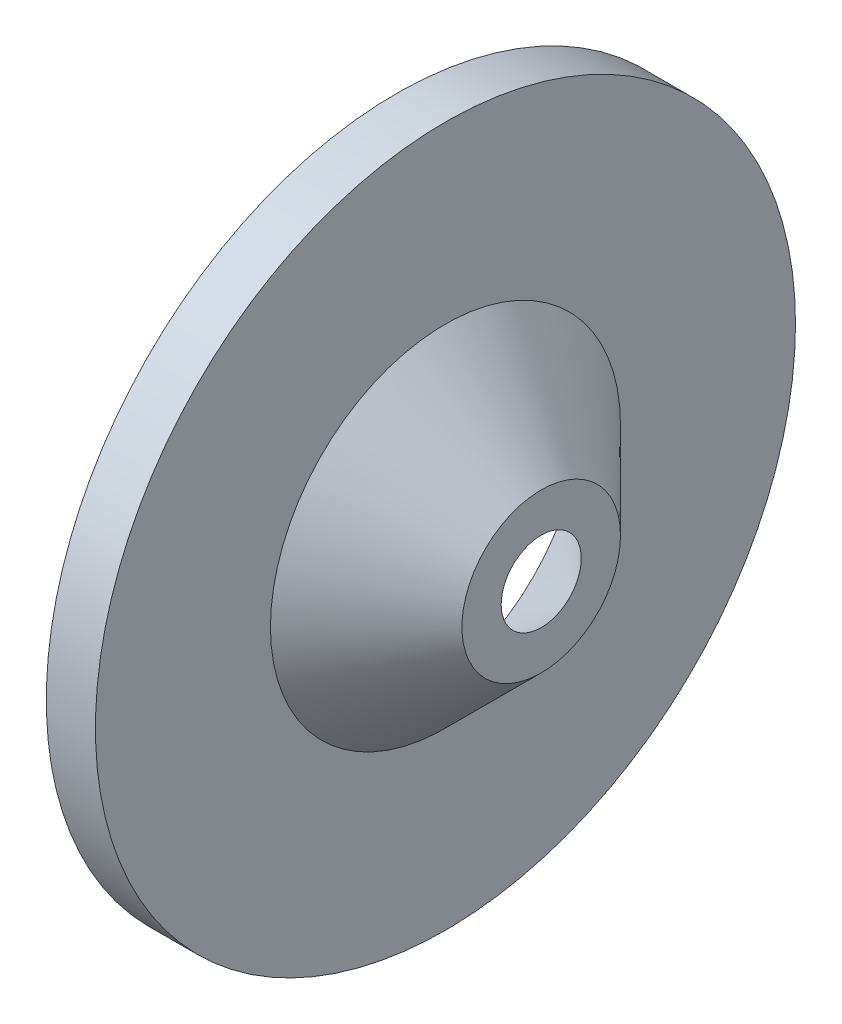
ISO-10303-21;
HEADER;
FILE_DESCRIPTION(('STEP AP214'),'2;1');
FILE_NAME('part.step','',(''),(''),'','','');
FILE_SCHEMA(('AUTOMOTIVE_DESIGN { 1 0 10303 214 1 1 1 1 }'));
ENDSEC;
DATA;
#1=APPLICATION_CONTEXT('core data for automotive mechanical design processes');
#2=APPLICATION_PROTOCOL_DEFINITION('international standard','automotive_design',2000,#1);
#3=PRODUCT_CONTEXT('',#1,'mechanical');
#4=PRODUCT('Part','Part','',(#3));
#5=PRODUCT_RELATED_PRODUCT_CATEGORY('part','',(#4));
#6=PRODUCT_DEFINITION_FORMATION('','',#4);
#7=PRODUCT_DEFINITION_CONTEXT('part definition',#1,'design');
#8=PRODUCT_DEFINITION('design','',#6,#7);
#9=PRODUCT_DEFINITION_SHAPE('','',#8);
#10=(LENGTH_UNIT() NAMED_UNIT(*) SI_UNIT(.MILLI.,.METRE.));
#11=(NAMED_UNIT(*) PLANE_ANGLE_UNIT() SI_UNIT($,.RADIAN.));
#12=(NAMED_UNIT(*) SI_UNIT($,.STERADIAN.) SOLID_ANGLE_UNIT());
#13=UNCERTAINTY_MEASURE_WITH_UNIT(LENGTH_MEASURE(1.E-05),#10,'distance_accuracy_value','');
#14=(GEOMETRIC_REPRESENTATION_CONTEXT(3) GLOBAL_UNCERTAINTY_ASSIGNED_CONTEXT((#13)) GLOBAL_UNIT_ASSIGNED_CONTEXT((#10,
#11,#12)) REPRESENTATION_CONTEXT('',''));
#15=CARTESIAN_POINT('',(0.,0.,0.));
#16=DIRECTION('',(0.,0.,1.));
#17=DIRECTION('',(1.,0.,0.));
#18=AXIS2_PLACEMENT_3D('',#15,#16,#17);
#19=CARTESIAN_POINT('',(0.,53.4279110522621,0.));
#20=DIRECTION('',(1.,0.,0.));
#21=DIRECTION('',(0.,0.,-1.));
#22=AXIS2_PLACEMENT_3D('',#19,#20,#21);
#23=PLANE('',#22);
#24=CARTESIAN_POINT('',(0.,53.4279110522621,0.));
#25=DIRECTION('',(1.,0.,0.));
#26=DIRECTION('',(0.,0.,-1.));
#27=AXIS2_PLACEMENT_3D('',#24,#25,#26);
#28=CIRCLE('',#27,116.138338813252);
#29=CARTESIAN_POINT('',(0.,53.4279110522621,-116.138338813252));
#30=VERTEX_POINT('',#29);
#31=EDGE_CURVE('E50',#30,#30,#28,.T.);
#32=ORIENTED_EDGE('',*,*,#31,.T.);
#33=EDGE_LOOP('',(#32));
#34=FACE_BOUND('',#33,.T.);
#35=CARTESIAN_POINT('',(0.,53.4279110522621,0.));
#36=DIRECTION('',(1.,0.,0.));
#37=DIRECTION('',(0.,0.,-1.));
#38=AXIS2_PLACEMENT_3D('',#35,#36,#37);
#39=CIRCLE('',#38,126.138338813252);
#40=CARTESIAN_POINT('',(0.,53.4279110522621,-126.138338813252));
#41=VERTEX_POINT('',#40);
#42=EDGE_CURVE('E10',#41,#41,#39,.T.);
#43=ORIENTED_EDGE('',*,*,#42,.F.);
#44=EDGE_LOOP('',(#43));
#45=FACE_BOUND('',#44,.T.);
#46=ADVANCED_FACE('F31',(#34,#45),#23,.F.);
#47=CARTESIAN_POINT('',(52.2034542362938,53.4279110522621,0.));
#48=DIRECTION('',(1.,0.,0.));
#49=DIRECTION('',(0.,0.,-1.));
#50=AXIS2_PLACEMENT_3D('',#47,#48,#49);
#51=CYLINDRICAL_SURFACE('',#50,126.138338813252);
#52=CARTESIAN_POINT('',(17.7032346079048,53.4279110522621,0.));
#53=DIRECTION('',(1.,0.,0.));
#54=DIRECTION('',(0.,0.,-1.));
#55=AXIS2_PLACEMENT_3D('',#52,#53,#54);
#56=CIRCLE('',#55,126.138338813252);
#57=CARTESIAN_POINT('',(17.7032346079048,53.4279110522621,-126.138338813252));
#58=VERTEX_POINT('',#57);
#59=EDGE_CURVE('E37',#58,#58,#56,.T.);
#60=ORIENTED_EDGE('',*,*,#59,.F.);
#61=EDGE_LOOP('',(#60));
#62=FACE_BOUND('',#61,.T.);
#63=ORIENTED_EDGE('',*,*,#42,.T.);
#64=EDGE_LOOP('',(#63));
#65=FACE_BOUND('',#64,.T.);
#66=ADVANCED_FACE('F80',(#62,#65),#51,.T.);
#67=CARTESIAN_POINT('',(17.7032346079048,-72.7104277609898,0.));
#68=DIRECTION('',(-1.,0.,0.));
#69=DIRECTION('',(0.,0.,1.));
#70=AXIS2_PLACEMENT_3D('',#67,#68,#69);
#71=PLANE('',#70);
#72=CARTESIAN_POINT('',(17.7032346079048,53.4279110522621,0.));
#73=DIRECTION('',(1.,0.,0.));
#74=DIRECTION('',(0.,0.,-1.));
#75=AXIS2_PLACEMENT_3D('',#72,#73,#74);
#76=CIRCLE('',#75,63.0691694066259);
#77=CARTESIAN_POINT('',(17.7032346079048,53.4279110522621,-63.0691694066259));
#78=VERTEX_POINT('',#77);
#79=EDGE_CURVE('E41',#78,#78,#76,.T.);
#80=ORIENTED_EDGE('',*,*,#79,.F.);
#81=EDGE_LOOP('',(#80));
#82=FACE_BOUND('',#81,.T.);
#83=ORIENTED_EDGE('',*,*,#59,.T.);
#84=EDGE_LOOP('',(#83));
#85=FACE_BOUND('',#84,.T.);
#86=ADVANCED_FACE('F85',(#82,#85),#71,.F.);
#87=CARTESIAN_POINT('',(17.7032346079048,53.4279110522621,0.));
#88=DIRECTION('',(-1.,0.,0.));
#89=DIRECTION('',(0.,0.,1.));
#90=AXIS2_PLACEMENT_3D('',#87,#88,#89);
#91=CONICAL_SURFACE('',#90,63.0691694066259,0.78539816339746);
#92=CARTESIAN_POINT('',(52.2034542362938,53.4279110522621,0.));
#93=DIRECTION('',(1.,0.,0.));
#94=DIRECTION('',(0.,0.,-1.));
#95=AXIS2_PLACEMENT_3D('',#92,#93,#94);
#96=CIRCLE('',#95,28.5689497782361);
#97=CARTESIAN_POINT('',(52.2034542362938,53.4279110522621,-28.5689497782361));
#98=VERTEX_POINT('',#97);
#99=EDGE_CURVE('E45',#98,#98,#96,.T.);
#100=ORIENTED_EDGE('',*,*,#99,.F.);
#101=EDGE_LOOP('',(#100));
#102=FACE_BOUND('',#101,.T.);
#103=ORIENTED_EDGE('',*,*,#79,.T.);
#104=EDGE_LOOP('',(#103));
#105=FACE_BOUND('',#104,.T.);
#106=ADVANCED_FACE('F92',(#102,#105),#91,.T.);
#107=CARTESIAN_POINT('',(52.2034542362938,24.858961274026,0.));
#108=DIRECTION('',(-1.,0.,0.));
#109=DIRECTION('',(0.,0.,1.));
#110=AXIS2_PLACEMENT_3D('',#107,#108,#109);
#111=PLANE('',#110);
#112=CARTESIAN_POINT('',(52.2034542362938,53.4279110522621,0.));
#113=DIRECTION('',(-1.,0.,0.));
#114=DIRECTION('',(0.,0.,1.));
#115=AXIS2_PLACEMENT_3D('',#112,#113,#114);
#116=CIRCLE('',#115,14.426814154505);
#117=CARTESIAN_POINT('',(52.2034542362938,53.4279110522621,14.426814154505));
#118=VERTEX_POINT('',#117);
#119=EDGE_CURVE('E51',#118,#118,#116,.F.);
#120=ORIENTED_EDGE('',*,*,#119,.F.);
#121=EDGE_LOOP('',(#120));
#122=FACE_BOUND('',#121,.T.);
#123=ORIENTED_EDGE('',*,*,#99,.T.);
#124=EDGE_LOOP('',(#123));
#125=FACE_BOUND('',#124,.T.);
#126=ADVANCED_FACE('F77',(#122,#125),#111,.F.);
#127=CARTESIAN_POINT('',(52.2034542362938,53.4279110522621,0.));
#128=DIRECTION('',(1.,0.,0.));
#129=DIRECTION('',(0.,0.,-1.));
#130=AXIS2_PLACEMENT_3D('',#127,#128,#129);
#131=CYLINDRICAL_SURFACE('',#130,116.138338813252);
#132=CARTESIAN_POINT('',(7.70323460790479,53.4279110522621,0.));
#133=DIRECTION('',(-1.,0.,0.));
#134=DIRECTION('',(0.,0.,1.));
#135=AXIS2_PLACEMENT_3D('',#132,#133,#134);
#136=CIRCLE('',#135,116.138338813252);
#137=CARTESIAN_POINT('',(7.70323460790479,53.4279110522621,116.138338813252));
#138=VERTEX_POINT('',#137);
#139=EDGE_CURVE('E57',#138,#138,#136,.F.);
#140=ORIENTED_EDGE('',*,*,#139,.T.);
#141=EDGE_LOOP('',(#140));
#142=FACE_BOUND('',#141,.T.);
#143=ORIENTED_EDGE('',*,*,#31,.F.);
#144=EDGE_LOOP('',(#143));
#145=FACE_BOUND('',#144,.T.);
#146=ADVANCED_FACE('F63',(#142,#145),#131,.F.);
#147=CARTESIAN_POINT('',(7.70323460790479,-72.7104277609898,0.));
#148=DIRECTION('',(-1.,0.,0.));
#149=DIRECTION('',(0.,0.,1.));
#150=AXIS2_PLACEMENT_3D('',#147,#148,#149);
#151=PLANE('',#150);
#152=CARTESIAN_POINT('',(7.70323460790479,53.4279110522621,0.));
#153=DIRECTION('',(-1.,0.,0.));
#154=DIRECTION('',(0.,0.,1.));
#155=AXIS2_PLACEMENT_3D('',#152,#153,#154);
#156=CIRCLE('',#155,58.927033782895);
#157=CARTESIAN_POINT('',(7.7032346079048,53.4279110522621,58.927033782895));
#158=VERTEX_POINT('',#157);
#159=EDGE_CURVE('E54',#158,#158,#156,.F.);
#160=ORIENTED_EDGE('',*,*,#159,.T.);
#161=EDGE_LOOP('',(#160));
#162=FACE_BOUND('',#161,.T.);
#163=ORIENTED_EDGE('',*,*,#139,.F.);
#164=EDGE_LOOP('',(#163));
#165=FACE_BOUND('',#164,.T.);
#166=ADVANCED_FACE('F66',(#162,#165),#151,.T.);
#167=CARTESIAN_POINT('',(10.6321667960392,53.4279110522621,0.));
#168=DIRECTION('',(-1.,0.,0.));
#169=DIRECTION('',(0.,0.,1.));
#170=AXIS2_PLACEMENT_3D('',#167,#168,#169);
#171=CONICAL_SURFACE('',#170,55.9981015947605,0.78539816339746);
#172=CARTESIAN_POINT('',(52.2034542362938,53.4279110522621,14.426814154505));
#173=CARTESIAN_POINT('',(51.7399102818314,53.4279110522621,14.8903581089674));
#174=CARTESIAN_POINT('',(51.276366327369,53.4279110522621,15.3539020634298));
#175=CARTESIAN_POINT('',(50.3492784184442,53.4279110522621,16.2809899723546));
#176=CARTESIAN_POINT('',(49.8857344639819,53.4279110522621,16.7445339268169));
#177=CARTESIAN_POINT('',(48.9586465550571,53.4279110522621,17.6716218357417));
#178=CARTESIAN_POINT('',(48.4951026005947,53.4279110522621,18.1351657902041));
#179=CARTESIAN_POINT('',(47.5680146916699,53.4279110522621,19.0622536991289));
#180=CARTESIAN_POINT('',(47.1044707372075,53.4279110522621,19.5257976535913));
#181=CARTESIAN_POINT('',(46.1773828282828,53.4279110522621,20.4528855625161));
#182=CARTESIAN_POINT('',(45.7138388738204,53.4279110522621,20.9164295169785));
#183=CARTESIAN_POINT('',(44.7867509648956,53.4279110522621,21.8435174259033));
#184=CARTESIAN_POINT('',(44.3232070104332,53.4279110522621,22.3070613803657));
#185=CARTESIAN_POINT('',(43.3961191015085,53.4279110522621,23.2341492892905));
#186=CARTESIAN_POINT('',(42.9325751470461,53.4279110522621,23.6976932437529));
#187=CARTESIAN_POINT('',(42.0054872381213,53.4279110522621,24.6247811526777));
#188=CARTESIAN_POINT('',(41.5419432836589,53.4279110522621,25.0883251071401));
#189=CARTESIAN_POINT('',(40.6148553747342,53.4279110522621,26.0154130160649));
#190=CARTESIAN_POINT('',(40.1513114202718,53.4279110522621,26.4789569705273));
#191=CARTESIAN_POINT('',(39.224223511347,53.4279110522621,27.4060448794521));
#192=CARTESIAN_POINT('',(38.7606795568846,53.4279110522621,27.8695888339145));
#193=CARTESIAN_POINT('',(37.8335916479598,53.4279110522621,28.7966767428393));
#194=CARTESIAN_POINT('',(37.3700476934975,53.4279110522621,29.2602206973017));
#195=CARTESIAN_POINT('',(36.4429597845727,53.4279110522621,30.1873086062265));
#196=CARTESIAN_POINT('',(35.9794158301103,53.4279110522621,30.6508525606889));
#197=CARTESIAN_POINT('',(35.0523279211855,53.4279110522621,31.5779404696136));
#198=CARTESIAN_POINT('',(34.5887839667231,53.4279110522621,32.041484424076));
#199=CARTESIAN_POINT('',(33.6616960577984,53.4279110522621,32.9685723330008));
#200=CARTESIAN_POINT('',(33.198152103336,53.4279110522621,33.4321162874632));
#201=CARTESIAN_POINT('',(32.2710641944112,53.4279110522621,34.359204196388));
#202=CARTESIAN_POINT('',(31.8075202399488,53.4279110522621,34.8227481508504));
#203=CARTESIAN_POINT('',(30.8804323310241,53.4279110522621,35.7498360597752));
#204=CARTESIAN_POINT('',(30.4168883765617,53.4279110522621,36.2133800142376));
#205=CARTESIAN_POINT('',(29.4898004676369,53.4279110522621,37.1404679231624));
#206=CARTESIAN_POINT('',(29.0262565131745,53.4279110522621,37.6040118776248));
#207=CARTESIAN_POINT('',(28.0991686042497,53.4279110522621,38.5310997865496));
#208=CARTESIAN_POINT('',(27.6356246497874,53.4279110522621,38.994643741012));
#209=CARTESIAN_POINT('',(26.7085367408626,53.4279110522621,39.9217316499368));
#210=CARTESIAN_POINT('',(26.2449927864002,53.4279110522621,40.3852756043992));
#211=CARTESIAN_POINT('',(25.3179048774754,53.4279110522621,41.312363513324));
#212=CARTESIAN_POINT('',(24.8543609230131,53.4279110522621,41.7759074677864));
#213=CARTESIAN_POINT('',(23.9272730140883,53.4279110522621,42.7029953767112));
#214=CARTESIAN_POINT('',(23.4637290596259,53.4279110522621,43.1665393311736));
#215=CARTESIAN_POINT('',(22.5366411507011,53.4279110522621,44.0936272400984));
#216=CARTESIAN_POINT('',(22.0730971962387,53.4279110522621,44.5571711945608));
#217=CARTESIAN_POINT('',(21.146009287314,53.4279110522621,45.4842591034855));
#218=CARTESIAN_POINT('',(20.6824653328516,53.4279110522621,45.9478030579479));
#219=CARTESIAN_POINT('',(19.7553774239268,53.4279110522621,46.8748909668727));
#220=CARTESIAN_POINT('',(19.2918334694644,53.4279110522621,47.3384349213351));
#221=CARTESIAN_POINT('',(18.3647455605397,53.4279110522621,48.2655228302599));
#222=CARTESIAN_POINT('',(17.9012016060773,53.4279110522621,48.7290667847223));
#223=CARTESIAN_POINT('',(16.9741136971525,53.4279110522621,49.6561546936471));
#224=CARTESIAN_POINT('',(16.5105697426901,53.4279110522621,50.1196986481095));
#225=CARTESIAN_POINT('',(15.5834818337653,53.4279110522621,51.0467865570343));
#226=CARTESIAN_POINT('',(15.119937879303,53.4279110522621,51.5103305114967));
#227=CARTESIAN_POINT('',(14.1928499703782,53.4279110522621,52.4374184204215));
#228=CARTESIAN_POINT('',(13.7293060159158,53.4279110522621,52.9009623748839));
#229=CARTESIAN_POINT('',(12.802218106991,53.4279110522621,53.8280502838087));
#230=CARTESIAN_POINT('',(12.3386741525286,53.4279110522621,54.2915942382711));
#231=CARTESIAN_POINT('',(11.4115862436039,53.4279110522621,55.2186821471959));
#232=CARTESIAN_POINT('',(10.9480422891415,53.4279110522621,55.6822261016583));
#233=CARTESIAN_POINT('',(10.0209543802167,53.4279110522621,56.6093140105831));
#234=CARTESIAN_POINT('',(9.55741042575434,53.4279110522621,57.0728579650455));
#235=CARTESIAN_POINT('',(8.63032251682956,53.4279110522621,57.9999458739702));
#236=CARTESIAN_POINT('',(8.16677856236718,53.4279110522621,58.4634898284326));
#237=CARTESIAN_POINT('',(7.70323460790479,53.4279110522621,58.927033782895));
#238=B_SPLINE_CURVE_WITH_KNOTS('',3,(#172,#173,#174,#175,#176,#177,#178,#179,#180,#181,#182,
#183,#184,#185,#186,#187,#188,#189,#190,#191,#192,#193,#194,#195,#196,#197,#198,#199,#200,#201,
#202,#203,#204,#205,#206,#207,#208,#209,#210,#211,#212,#213,#214,#215,#216,#217,#218,#219,#220,
#221,#222,#223,#224,#225,#226,#227,#228,#229,#230,#231,#232,#233,#234,#235,#236,#237),
.UNSPECIFIED.,.F.,.F.,(4,2,2,2,2,2,2,2,2,2,2,2,2,2,2,2,2,2,2,2,2,2,2,2,2,2,2,2,2,2,2,2,4),(0.,
1.96665044147031,3.93330088294062,5.89995132441093,7.86660176588124,9.83325220735155,
11.7999026488219,13.7665530902922,15.7332035317625,17.6998539732328,19.6665044147031,
21.6331548561734,23.5998052976437,25.566455739114,27.5331061805843,29.4997566220546,
31.466407063525,33.4330575049953,35.3997079464656,37.3663583879359,39.3330088294062,
41.2996592708765,43.2663097123468,45.2329601538171,47.1996105952874,49.1662610367577,
51.1329114782281,53.0995619196984,55.0662123611687,57.032862802639,58.9995132441093,
60.9661636855796,62.9328141270499),.UNSPECIFIED.);
#239=EDGE_CURVE('BSEAM68',#118,#158,#238,.T.);
#240=ORIENTED_EDGE('',*,*,#119,.T.);
#241=ORIENTED_EDGE('',*,*,#159,.F.);
#242=ORIENTED_EDGE('',*,*,#239,.T.);
#243=ORIENTED_EDGE('',*,*,#239,.F.);
#244=EDGE_LOOP('',(#240,#242,#241,#243));
#245=FACE_BOUND('',#244,.T.);
#246=ADVANCED_FACE('F68',(#245),#171,.F.);
#247=CLOSED_SHELL('',(#46,#66,#86,#106,#126,#146,#166,#246));
#248=MANIFOLD_SOLID_BREP('B2',#247);
#249=ADVANCED_BREP_SHAPE_REPRESENTATION('',(#18,#248),#14);
#250=SHAPE_DEFINITION_REPRESENTATION(#9,#249);
ENDSEC;
END-ISO-10303-21;
